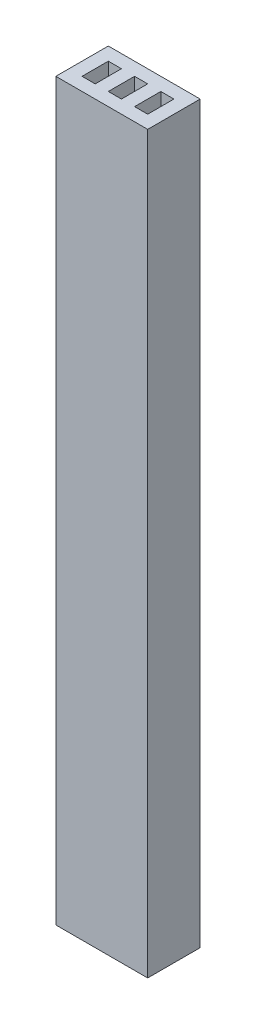
ISO-10303-21;
HEADER;
FILE_DESCRIPTION(('STEP AP214'),'2;1');
FILE_NAME('part.step','',(''),(''),'','','');
FILE_SCHEMA(('AUTOMOTIVE_DESIGN { 1 0 10303 214 1 1 1 1 }'));
ENDSEC;
DATA;
#1=APPLICATION_CONTEXT('core data for automotive mechanical design processes');
#2=APPLICATION_PROTOCOL_DEFINITION('international standard','automotive_design',2000,#1);
#3=PRODUCT_CONTEXT('',#1,'mechanical');
#4=PRODUCT('Part','Part','',(#3));
#5=PRODUCT_RELATED_PRODUCT_CATEGORY('part','',(#4));
#6=PRODUCT_DEFINITION_FORMATION('','',#4);
#7=PRODUCT_DEFINITION_CONTEXT('part definition',#1,'design');
#8=PRODUCT_DEFINITION('design','',#6,#7);
#9=PRODUCT_DEFINITION_SHAPE('','',#8);
#10=(LENGTH_UNIT() NAMED_UNIT(*) SI_UNIT(.MILLI.,.METRE.));
#11=(NAMED_UNIT(*) PLANE_ANGLE_UNIT() SI_UNIT($,.RADIAN.));
#12=(NAMED_UNIT(*) SI_UNIT($,.STERADIAN.) SOLID_ANGLE_UNIT());
#13=UNCERTAINTY_MEASURE_WITH_UNIT(LENGTH_MEASURE(1.E-05),#10,'distance_accuracy_value','');
#14=(GEOMETRIC_REPRESENTATION_CONTEXT(3) GLOBAL_UNCERTAINTY_ASSIGNED_CONTEXT((#13)) GLOBAL_UNIT_ASSIGNED_CONTEXT((#10,
#11,#12)) REPRESENTATION_CONTEXT('',''));
#15=CARTESIAN_POINT('',(0.,0.,0.));
#16=DIRECTION('',(0.,0.,1.));
#17=DIRECTION('',(1.,0.,0.));
#18=AXIS2_PLACEMENT_3D('',#15,#16,#17);
#19=CARTESIAN_POINT('',(0.,56.,0.));
#20=DIRECTION('',(0.,1.,0.));
#21=DIRECTION('',(0.,0.,1.));
#22=AXIS2_PLACEMENT_3D('',#19,#20,#21);
#23=PLANE('',#22);
#24=DIRECTION('',(0.,0.,-1.));
#25=VECTOR('',#24,1.);
#26=CARTESIAN_POINT('',(6.,56.,-3.));
#27=LINE('',#26,#25);
#28=CARTESIAN_POINT('',(6.,56.,1.));
#29=VERTEX_POINT('',#28);
#30=CARTESIAN_POINT('',(6.,56.,-3.));
#31=VERTEX_POINT('',#30);
#32=EDGE_CURVE('E244',#29,#31,#27,.T.);
#33=ORIENTED_EDGE('',*,*,#32,.T.);
#34=DIRECTION('',(-1.,0.,0.));
#35=VECTOR('',#34,1.);
#36=CARTESIAN_POINT('',(-1.,56.,-3.));
#37=LINE('',#36,#35);
#38=CARTESIAN_POINT('',(-1.,56.,-3.));
#39=VERTEX_POINT('',#38);
#40=EDGE_CURVE('E247',#31,#39,#37,.T.);
#41=ORIENTED_EDGE('',*,*,#40,.T.);
#42=DIRECTION('',(0.,0.,1.));
#43=VECTOR('',#42,1.);
#44=CARTESIAN_POINT('',(-1.,56.,-3.));
#45=LINE('',#44,#43);
#46=CARTESIAN_POINT('',(-1.,56.,1.));
#47=VERTEX_POINT('',#46);
#48=EDGE_CURVE('E250',#39,#47,#45,.T.);
#49=ORIENTED_EDGE('',*,*,#48,.T.);
#50=DIRECTION('',(1.,0.,0.));
#51=VECTOR('',#50,1.);
#52=CARTESIAN_POINT('',(-1.,56.,1.));
#53=LINE('',#52,#51);
#54=EDGE_CURVE('E252',#47,#29,#53,.T.);
#55=ORIENTED_EDGE('',*,*,#54,.T.);
#56=EDGE_LOOP('',(#33,#41,#49,#55));
#57=FACE_BOUND('',#56,.T.);
#58=DIRECTION('',(1.,0.,0.));
#59=VECTOR('',#58,1.);
#60=CARTESIAN_POINT('',(0.,56.,0.));
#61=LINE('',#60,#59);
#62=CARTESIAN_POINT('',(0.,56.,0.));
#63=VERTEX_POINT('',#62);
#64=CARTESIAN_POINT('',(1.,56.,0.));
#65=VERTEX_POINT('',#64);
#66=EDGE_CURVE('E215',#63,#65,#61,.T.);
#67=ORIENTED_EDGE('',*,*,#66,.F.);
#68=DIRECTION('',(0.,0.,1.));
#69=VECTOR('',#68,1.);
#70=CARTESIAN_POINT('',(0.,56.,0.));
#71=LINE('',#70,#69);
#72=CARTESIAN_POINT('',(0.,56.,-2.));
#73=VERTEX_POINT('',#72);
#74=EDGE_CURVE('E213',#73,#63,#71,.T.);
#75=ORIENTED_EDGE('',*,*,#74,.F.);
#76=DIRECTION('',(-1.,0.,0.));
#77=VECTOR('',#76,1.);
#78=CARTESIAN_POINT('',(0.,56.,-2.));
#79=LINE('',#78,#77);
#80=CARTESIAN_POINT('',(1.,56.,-2.));
#81=VERTEX_POINT('',#80);
#82=EDGE_CURVE('E221',#81,#73,#79,.T.);
#83=ORIENTED_EDGE('',*,*,#82,.F.);
#84=DIRECTION('',(0.,0.,-1.));
#85=VECTOR('',#84,1.);
#86=CARTESIAN_POINT('',(1.,56.,0.));
#87=LINE('',#86,#85);
#88=EDGE_CURVE('E218',#65,#81,#87,.T.);
#89=ORIENTED_EDGE('',*,*,#88,.F.);
#90=EDGE_LOOP('',(#67,#75,#83,#89));
#91=FACE_BOUND('',#90,.T.);
#92=DIRECTION('',(-1.,0.,0.));
#93=VECTOR('',#92,1.);
#94=CARTESIAN_POINT('',(2.,56.,-2.));
#95=LINE('',#94,#93);
#96=CARTESIAN_POINT('',(3.,56.,-2.));
#97=VERTEX_POINT('',#96);
#98=CARTESIAN_POINT('',(2.,56.,-2.));
#99=VERTEX_POINT('',#98);
#100=EDGE_CURVE('E184',#97,#99,#95,.T.);
#101=ORIENTED_EDGE('',*,*,#100,.F.);
#102=DIRECTION('',(0.,0.,-1.));
#103=VECTOR('',#102,1.);
#104=CARTESIAN_POINT('',(3.,56.,0.));
#105=LINE('',#104,#103);
#106=CARTESIAN_POINT('',(3.,56.,0.));
#107=VERTEX_POINT('',#106);
#108=EDGE_CURVE('E182',#107,#97,#105,.T.);
#109=ORIENTED_EDGE('',*,*,#108,.F.);
#110=DIRECTION('',(1.,0.,0.));
#111=VECTOR('',#110,1.);
#112=CARTESIAN_POINT('',(2.,56.,0.));
#113=LINE('',#112,#111);
#114=CARTESIAN_POINT('',(2.,56.,0.));
#115=VERTEX_POINT('',#114);
#116=EDGE_CURVE('E190',#115,#107,#113,.T.);
#117=ORIENTED_EDGE('',*,*,#116,.F.);
#118=DIRECTION('',(0.,0.,1.));
#119=VECTOR('',#118,1.);
#120=CARTESIAN_POINT('',(2.,56.,0.));
#121=LINE('',#120,#119);
#122=EDGE_CURVE('E187',#99,#115,#121,.T.);
#123=ORIENTED_EDGE('',*,*,#122,.F.);
#124=EDGE_LOOP('',(#101,#109,#117,#123));
#125=FACE_BOUND('',#124,.T.);
#126=DIRECTION('',(-1.,0.,0.));
#127=VECTOR('',#126,1.);
#128=CARTESIAN_POINT('',(4.,56.,-2.));
#129=LINE('',#128,#127);
#130=CARTESIAN_POINT('',(5.,56.,-2.));
#131=VERTEX_POINT('',#130);
#132=CARTESIAN_POINT('',(4.,56.,-2.));
#133=VERTEX_POINT('',#132);
#134=EDGE_CURVE('E154',#131,#133,#129,.T.);
#135=ORIENTED_EDGE('',*,*,#134,.F.);
#136=DIRECTION('',(0.,0.,-1.));
#137=VECTOR('',#136,1.);
#138=CARTESIAN_POINT('',(5.,56.,0.));
#139=LINE('',#138,#137);
#140=CARTESIAN_POINT('',(5.,56.,0.));
#141=VERTEX_POINT('',#140);
#142=EDGE_CURVE('E146',#141,#131,#139,.T.);
#143=ORIENTED_EDGE('',*,*,#142,.F.);
#144=DIRECTION('',(1.,0.,0.));
#145=VECTOR('',#144,1.);
#146=CARTESIAN_POINT('',(4.,56.,0.));
#147=LINE('',#146,#145);
#148=CARTESIAN_POINT('',(4.,56.,0.));
#149=VERTEX_POINT('',#148);
#150=EDGE_CURVE('E168',#149,#141,#147,.T.);
#151=ORIENTED_EDGE('',*,*,#150,.F.);
#152=DIRECTION('',(0.,0.,1.));
#153=VECTOR('',#152,1.);
#154=CARTESIAN_POINT('',(4.,56.,0.));
#155=LINE('',#154,#153);
#156=EDGE_CURVE('E166',#133,#149,#155,.T.);
#157=ORIENTED_EDGE('',*,*,#156,.F.);
#158=EDGE_LOOP('',(#135,#143,#151,#157));
#159=FACE_BOUND('',#158,.T.);
#160=ADVANCED_FACE('F33',(#57,#91,#125,#159),#23,.T.);
#161=CARTESIAN_POINT('',(0.,0.,0.));
#162=DIRECTION('',(0.,1.,0.));
#163=DIRECTION('',(0.,0.,1.));
#164=AXIS2_PLACEMENT_3D('',#161,#162,#163);
#165=PLANE('',#164);
#166=DIRECTION('',(0.,0.,-1.));
#167=VECTOR('',#166,1.);
#168=CARTESIAN_POINT('',(3.,0.,0.));
#169=LINE('',#168,#167);
#170=CARTESIAN_POINT('',(3.,0.,0.));
#171=VERTEX_POINT('',#170);
#172=CARTESIAN_POINT('',(3.,0.,-2.));
#173=VERTEX_POINT('',#172);
#174=EDGE_CURVE('E162',#171,#173,#169,.T.);
#175=ORIENTED_EDGE('',*,*,#174,.T.);
#176=DIRECTION('',(-1.,0.,0.));
#177=VECTOR('',#176,1.);
#178=CARTESIAN_POINT('',(2.,0.,-2.));
#179=LINE('',#178,#177);
#180=CARTESIAN_POINT('',(2.,0.,-2.));
#181=VERTEX_POINT('',#180);
#182=EDGE_CURVE('E195',#173,#181,#179,.T.);
#183=ORIENTED_EDGE('',*,*,#182,.T.);
#184=DIRECTION('',(0.,0.,1.));
#185=VECTOR('',#184,1.);
#186=CARTESIAN_POINT('',(2.,0.,0.));
#187=LINE('',#186,#185);
#188=CARTESIAN_POINT('',(2.,0.,0.));
#189=VERTEX_POINT('',#188);
#190=EDGE_CURVE('E198',#181,#189,#187,.T.);
#191=ORIENTED_EDGE('',*,*,#190,.T.);
#192=DIRECTION('',(1.,0.,0.));
#193=VECTOR('',#192,1.);
#194=CARTESIAN_POINT('',(2.,0.,0.));
#195=LINE('',#194,#193);
#196=EDGE_CURVE('E185',#189,#171,#195,.T.);
#197=ORIENTED_EDGE('',*,*,#196,.T.);
#198=EDGE_LOOP('',(#175,#183,#191,#197));
#199=FACE_BOUND('',#198,.T.);
#200=DIRECTION('',(0.,0.,-1.));
#201=VECTOR('',#200,1.);
#202=CARTESIAN_POINT('',(6.,0.,-3.));
#203=LINE('',#202,#201);
#204=CARTESIAN_POINT('',(6.,0.,1.));
#205=VERTEX_POINT('',#204);
#206=CARTESIAN_POINT('',(6.,0.,-3.));
#207=VERTEX_POINT('',#206);
#208=EDGE_CURVE('E243',#205,#207,#203,.T.);
#209=ORIENTED_EDGE('',*,*,#208,.F.);
#210=DIRECTION('',(1.,0.,0.));
#211=VECTOR('',#210,1.);
#212=CARTESIAN_POINT('',(-1.,0.,1.));
#213=LINE('',#212,#211);
#214=CARTESIAN_POINT('',(-1.,0.,1.));
#215=VERTEX_POINT('',#214);
#216=EDGE_CURVE('E248',#215,#205,#213,.T.);
#217=ORIENTED_EDGE('',*,*,#216,.F.);
#218=DIRECTION('',(0.,0.,1.));
#219=VECTOR('',#218,1.);
#220=CARTESIAN_POINT('',(-1.,0.,-3.));
#221=LINE('',#220,#219);
#222=CARTESIAN_POINT('',(-1.,0.,-3.));
#223=VERTEX_POINT('',#222);
#224=EDGE_CURVE('E259',#223,#215,#221,.T.);
#225=ORIENTED_EDGE('',*,*,#224,.F.);
#226=DIRECTION('',(-1.,0.,0.));
#227=VECTOR('',#226,1.);
#228=CARTESIAN_POINT('',(-1.,0.,-3.));
#229=LINE('',#228,#227);
#230=EDGE_CURVE('E257',#207,#223,#229,.T.);
#231=ORIENTED_EDGE('',*,*,#230,.F.);
#232=EDGE_LOOP('',(#209,#217,#225,#231));
#233=FACE_BOUND('',#232,.T.);
#234=DIRECTION('',(0.,0.,1.));
#235=VECTOR('',#234,1.);
#236=CARTESIAN_POINT('',(0.,0.,0.));
#237=LINE('',#236,#235);
#238=CARTESIAN_POINT('',(0.,0.,-2.));
#239=VERTEX_POINT('',#238);
#240=CARTESIAN_POINT('',(0.,0.,0.));
#241=VERTEX_POINT('',#240);
#242=EDGE_CURVE('E212',#239,#241,#237,.T.);
#243=ORIENTED_EDGE('',*,*,#242,.T.);
#244=DIRECTION('',(1.,0.,0.));
#245=VECTOR('',#244,1.);
#246=CARTESIAN_POINT('',(0.,0.,0.));
#247=LINE('',#246,#245);
#248=CARTESIAN_POINT('',(1.,0.,0.));
#249=VERTEX_POINT('',#248);
#250=EDGE_CURVE('E226',#241,#249,#247,.T.);
#251=ORIENTED_EDGE('',*,*,#250,.T.);
#252=DIRECTION('',(0.,0.,-1.));
#253=VECTOR('',#252,1.);
#254=CARTESIAN_POINT('',(1.,0.,0.));
#255=LINE('',#254,#253);
#256=CARTESIAN_POINT('',(1.,0.,-2.));
#257=VERTEX_POINT('',#256);
#258=EDGE_CURVE('E229',#249,#257,#255,.T.);
#259=ORIENTED_EDGE('',*,*,#258,.T.);
#260=DIRECTION('',(-1.,0.,0.));
#261=VECTOR('',#260,1.);
#262=CARTESIAN_POINT('',(0.,0.,-2.));
#263=LINE('',#262,#261);
#264=EDGE_CURVE('E216',#257,#239,#263,.T.);
#265=ORIENTED_EDGE('',*,*,#264,.T.);
#266=EDGE_LOOP('',(#243,#251,#259,#265));
#267=FACE_BOUND('',#266,.T.);
#268=DIRECTION('',(0.,0.,-1.));
#269=VECTOR('',#268,1.);
#270=CARTESIAN_POINT('',(5.,0.,0.));
#271=LINE('',#270,#269);
#272=CARTESIAN_POINT('',(5.,0.,0.));
#273=VERTEX_POINT('',#272);
#274=CARTESIAN_POINT('',(5.,0.,-2.));
#275=VERTEX_POINT('',#274);
#276=EDGE_CURVE('E56',#273,#275,#271,.T.);
#277=ORIENTED_EDGE('',*,*,#276,.T.);
#278=DIRECTION('',(-1.,0.,0.));
#279=VECTOR('',#278,1.);
#280=CARTESIAN_POINT('',(4.,0.,-2.));
#281=LINE('',#280,#279);
#282=CARTESIAN_POINT('',(4.,0.,-2.));
#283=VERTEX_POINT('',#282);
#284=EDGE_CURVE('E161',#275,#283,#281,.T.);
#285=ORIENTED_EDGE('',*,*,#284,.T.);
#286=DIRECTION('',(0.,0.,1.));
#287=VECTOR('',#286,1.);
#288=CARTESIAN_POINT('',(4.,0.,0.));
#289=LINE('',#288,#287);
#290=CARTESIAN_POINT('',(4.,0.,0.));
#291=VERTEX_POINT('',#290);
#292=EDGE_CURVE('E174',#283,#291,#289,.T.);
#293=ORIENTED_EDGE('',*,*,#292,.T.);
#294=DIRECTION('',(1.,0.,0.));
#295=VECTOR('',#294,1.);
#296=CARTESIAN_POINT('',(4.,0.,0.));
#297=LINE('',#296,#295);
#298=EDGE_CURVE('E155',#291,#273,#297,.T.);
#299=ORIENTED_EDGE('',*,*,#298,.T.);
#300=EDGE_LOOP('',(#277,#285,#293,#299));
#301=FACE_BOUND('',#300,.T.);
#302=ADVANCED_FACE('F277',(#199,#233,#267,#301),#165,.F.);
#303=CARTESIAN_POINT('',(6.,56.,-3.));
#304=DIRECTION('',(-1.,0.,0.));
#305=DIRECTION('',(0.,0.,1.));
#306=AXIS2_PLACEMENT_3D('',#303,#304,#305);
#307=PLANE('',#306);
#308=ORIENTED_EDGE('',*,*,#208,.T.);
#309=DIRECTION('',(0.,-1.,0.));
#310=VECTOR('',#309,1.);
#311=CARTESIAN_POINT('',(6.,56.,-3.));
#312=LINE('',#311,#310);
#313=EDGE_CURVE('E11',#31,#207,#312,.T.);
#314=ORIENTED_EDGE('',*,*,#313,.F.);
#315=ORIENTED_EDGE('',*,*,#32,.F.);
#316=DIRECTION('',(0.,-1.,0.));
#317=VECTOR('',#316,1.);
#318=CARTESIAN_POINT('',(6.,56.,1.));
#319=LINE('',#318,#317);
#320=EDGE_CURVE('E254',#29,#205,#319,.T.);
#321=ORIENTED_EDGE('',*,*,#320,.T.);
#322=EDGE_LOOP('',(#308,#314,#315,#321));
#323=FACE_BOUND('',#322,.T.);
#324=ADVANCED_FACE('F35',(#323),#307,.F.);
#325=CARTESIAN_POINT('',(-1.,56.,-3.));
#326=DIRECTION('',(0.,0.,1.));
#327=DIRECTION('',(1.,0.,0.));
#328=AXIS2_PLACEMENT_3D('',#325,#326,#327);
#329=PLANE('',#328);
#330=ORIENTED_EDGE('',*,*,#230,.T.);
#331=DIRECTION('',(0.,-1.,0.));
#332=VECTOR('',#331,1.);
#333=CARTESIAN_POINT('',(-1.,56.,-3.));
#334=LINE('',#333,#332);
#335=EDGE_CURVE('E41',#39,#223,#334,.T.);
#336=ORIENTED_EDGE('',*,*,#335,.F.);
#337=ORIENTED_EDGE('',*,*,#40,.F.);
#338=ORIENTED_EDGE('',*,*,#313,.T.);
#339=EDGE_LOOP('',(#330,#336,#337,#338));
#340=FACE_BOUND('',#339,.T.);
#341=ADVANCED_FACE('F288',(#340),#329,.F.);
#342=CARTESIAN_POINT('',(-1.,56.,-3.));
#343=DIRECTION('',(1.,0.,0.));
#344=DIRECTION('',(0.,0.,-1.));
#345=AXIS2_PLACEMENT_3D('',#342,#343,#344);
#346=PLANE('',#345);
#347=ORIENTED_EDGE('',*,*,#224,.T.);
#348=DIRECTION('',(0.,-1.,0.));
#349=VECTOR('',#348,1.);
#350=CARTESIAN_POINT('',(-1.,56.,1.));
#351=LINE('',#350,#349);
#352=EDGE_CURVE('E264',#47,#215,#351,.T.);
#353=ORIENTED_EDGE('',*,*,#352,.F.);
#354=ORIENTED_EDGE('',*,*,#48,.F.);
#355=ORIENTED_EDGE('',*,*,#335,.T.);
#356=EDGE_LOOP('',(#347,#353,#354,#355));
#357=FACE_BOUND('',#356,.T.);
#358=ADVANCED_FACE('F271',(#357),#346,.F.);
#359=CARTESIAN_POINT('',(-1.,56.,1.));
#360=DIRECTION('',(0.,0.,-1.));
#361=DIRECTION('',(-1.,0.,0.));
#362=AXIS2_PLACEMENT_3D('',#359,#360,#361);
#363=PLANE('',#362);
#364=ORIENTED_EDGE('',*,*,#216,.T.);
#365=ORIENTED_EDGE('',*,*,#320,.F.);
#366=ORIENTED_EDGE('',*,*,#54,.F.);
#367=ORIENTED_EDGE('',*,*,#352,.T.);
#368=EDGE_LOOP('',(#364,#365,#366,#367));
#369=FACE_BOUND('',#368,.T.);
#370=ADVANCED_FACE('F281',(#369),#363,.F.);
#371=CARTESIAN_POINT('',(0.,56.,0.));
#372=DIRECTION('',(1.,0.,0.));
#373=DIRECTION('',(0.,0.,-1.));
#374=AXIS2_PLACEMENT_3D('',#371,#372,#373);
#375=PLANE('',#374);
#376=ORIENTED_EDGE('',*,*,#242,.F.);
#377=DIRECTION('',(0.,-1.,0.));
#378=VECTOR('',#377,1.);
#379=CARTESIAN_POINT('',(0.,56.,-2.));
#380=LINE('',#379,#378);
#381=EDGE_CURVE('E223',#73,#239,#380,.T.);
#382=ORIENTED_EDGE('',*,*,#381,.F.);
#383=ORIENTED_EDGE('',*,*,#74,.T.);
#384=DIRECTION('',(0.,-1.,0.));
#385=VECTOR('',#384,1.);
#386=CARTESIAN_POINT('',(0.,56.,0.));
#387=LINE('',#386,#385);
#388=EDGE_CURVE('E240',#63,#241,#387,.T.);
#389=ORIENTED_EDGE('',*,*,#388,.T.);
#390=EDGE_LOOP('',(#376,#382,#383,#389));
#391=FACE_BOUND('',#390,.T.);
#392=ADVANCED_FACE('F303',(#391),#375,.T.);
#393=CARTESIAN_POINT('',(0.,56.,0.));
#394=DIRECTION('',(0.,0.,-1.));
#395=DIRECTION('',(-1.,0.,0.));
#396=AXIS2_PLACEMENT_3D('',#393,#394,#395);
#397=PLANE('',#396);
#398=ORIENTED_EDGE('',*,*,#250,.F.);
#399=ORIENTED_EDGE('',*,*,#388,.F.);
#400=ORIENTED_EDGE('',*,*,#66,.T.);
#401=DIRECTION('',(0.,-1.,0.));
#402=VECTOR('',#401,1.);
#403=CARTESIAN_POINT('',(1.,56.,0.));
#404=LINE('',#403,#402);
#405=EDGE_CURVE('E238',#65,#249,#404,.T.);
#406=ORIENTED_EDGE('',*,*,#405,.T.);
#407=EDGE_LOOP('',(#398,#399,#400,#406));
#408=FACE_BOUND('',#407,.T.);
#409=ADVANCED_FACE('F310',(#408),#397,.T.);
#410=CARTESIAN_POINT('',(1.,56.,0.));
#411=DIRECTION('',(-1.,0.,0.));
#412=DIRECTION('',(0.,0.,1.));
#413=AXIS2_PLACEMENT_3D('',#410,#411,#412);
#414=PLANE('',#413);
#415=ORIENTED_EDGE('',*,*,#258,.F.);
#416=ORIENTED_EDGE('',*,*,#405,.F.);
#417=ORIENTED_EDGE('',*,*,#88,.T.);
#418=DIRECTION('',(0.,-1.,0.));
#419=VECTOR('',#418,1.);
#420=CARTESIAN_POINT('',(1.,56.,-2.));
#421=LINE('',#420,#419);
#422=EDGE_CURVE('E236',#81,#257,#421,.T.);
#423=ORIENTED_EDGE('',*,*,#422,.T.);
#424=EDGE_LOOP('',(#415,#416,#417,#423));
#425=FACE_BOUND('',#424,.T.);
#426=ADVANCED_FACE('F315',(#425),#414,.T.);
#427=CARTESIAN_POINT('',(0.,56.,-2.));
#428=DIRECTION('',(0.,0.,1.));
#429=DIRECTION('',(1.,0.,0.));
#430=AXIS2_PLACEMENT_3D('',#427,#428,#429);
#431=PLANE('',#430);
#432=ORIENTED_EDGE('',*,*,#264,.F.);
#433=ORIENTED_EDGE('',*,*,#422,.F.);
#434=ORIENTED_EDGE('',*,*,#82,.T.);
#435=ORIENTED_EDGE('',*,*,#381,.T.);
#436=EDGE_LOOP('',(#432,#433,#434,#435));
#437=FACE_BOUND('',#436,.T.);
#438=ADVANCED_FACE('F322',(#437),#431,.T.);
#439=CARTESIAN_POINT('',(3.,56.,0.));
#440=DIRECTION('',(-1.,0.,0.));
#441=DIRECTION('',(0.,0.,1.));
#442=AXIS2_PLACEMENT_3D('',#439,#440,#441);
#443=PLANE('',#442);
#444=ORIENTED_EDGE('',*,*,#174,.F.);
#445=DIRECTION('',(0.,-1.,0.));
#446=VECTOR('',#445,1.);
#447=CARTESIAN_POINT('',(3.,56.,0.));
#448=LINE('',#447,#446);
#449=EDGE_CURVE('E192',#107,#171,#448,.T.);
#450=ORIENTED_EDGE('',*,*,#449,.F.);
#451=ORIENTED_EDGE('',*,*,#108,.T.);
#452=DIRECTION('',(0.,-1.,0.));
#453=VECTOR('',#452,1.);
#454=CARTESIAN_POINT('',(3.,56.,-2.));
#455=LINE('',#454,#453);
#456=EDGE_CURVE('E209',#97,#173,#455,.T.);
#457=ORIENTED_EDGE('',*,*,#456,.T.);
#458=EDGE_LOOP('',(#444,#450,#451,#457));
#459=FACE_BOUND('',#458,.T.);
#460=ADVANCED_FACE('F344',(#459),#443,.T.);
#461=CARTESIAN_POINT('',(2.,56.,-2.));
#462=DIRECTION('',(0.,0.,1.));
#463=DIRECTION('',(1.,0.,0.));
#464=AXIS2_PLACEMENT_3D('',#461,#462,#463);
#465=PLANE('',#464);
#466=ORIENTED_EDGE('',*,*,#182,.F.);
#467=ORIENTED_EDGE('',*,*,#456,.F.);
#468=ORIENTED_EDGE('',*,*,#100,.T.);
#469=DIRECTION('',(0.,-1.,0.));
#470=VECTOR('',#469,1.);
#471=CARTESIAN_POINT('',(2.,56.,-2.));
#472=LINE('',#471,#470);
#473=EDGE_CURVE('E207',#99,#181,#472,.T.);
#474=ORIENTED_EDGE('',*,*,#473,.T.);
#475=EDGE_LOOP('',(#466,#467,#468,#474));
#476=FACE_BOUND('',#475,.T.);
#477=ADVANCED_FACE('F338',(#476),#465,.T.);
#478=CARTESIAN_POINT('',(2.,56.,0.));
#479=DIRECTION('',(1.,0.,0.));
#480=DIRECTION('',(0.,0.,-1.));
#481=AXIS2_PLACEMENT_3D('',#478,#479,#480);
#482=PLANE('',#481);
#483=ORIENTED_EDGE('',*,*,#190,.F.);
#484=ORIENTED_EDGE('',*,*,#473,.F.);
#485=ORIENTED_EDGE('',*,*,#122,.T.);
#486=DIRECTION('',(0.,-1.,0.));
#487=VECTOR('',#486,1.);
#488=CARTESIAN_POINT('',(2.,56.,0.));
#489=LINE('',#488,#487);
#490=EDGE_CURVE('E205',#115,#189,#489,.T.);
#491=ORIENTED_EDGE('',*,*,#490,.T.);
#492=EDGE_LOOP('',(#483,#484,#485,#491));
#493=FACE_BOUND('',#492,.T.);
#494=ADVANCED_FACE('F341',(#493),#482,.T.);
#495=CARTESIAN_POINT('',(2.,56.,0.));
#496=DIRECTION('',(0.,0.,-1.));
#497=DIRECTION('',(-1.,0.,0.));
#498=AXIS2_PLACEMENT_3D('',#495,#496,#497);
#499=PLANE('',#498);
#500=ORIENTED_EDGE('',*,*,#196,.F.);
#501=ORIENTED_EDGE('',*,*,#490,.F.);
#502=ORIENTED_EDGE('',*,*,#116,.T.);
#503=ORIENTED_EDGE('',*,*,#449,.T.);
#504=EDGE_LOOP('',(#500,#501,#502,#503));
#505=FACE_BOUND('',#504,.T.);
#506=ADVANCED_FACE('F347',(#505),#499,.T.);
#507=CARTESIAN_POINT('',(5.,56.,0.));
#508=DIRECTION('',(-1.,0.,0.));
#509=DIRECTION('',(0.,0.,1.));
#510=AXIS2_PLACEMENT_3D('',#507,#508,#509);
#511=PLANE('',#510);
#512=ORIENTED_EDGE('',*,*,#276,.F.);
#513=DIRECTION('',(0.,-1.,0.));
#514=VECTOR('',#513,1.);
#515=CARTESIAN_POINT('',(5.,56.,0.));
#516=LINE('',#515,#514);
#517=EDGE_CURVE('E150',#141,#273,#516,.T.);
#518=ORIENTED_EDGE('',*,*,#517,.F.);
#519=ORIENTED_EDGE('',*,*,#142,.T.);
#520=DIRECTION('',(0.,-1.,0.));
#521=VECTOR('',#520,1.);
#522=CARTESIAN_POINT('',(5.,56.,-2.));
#523=LINE('',#522,#521);
#524=EDGE_CURVE('E149',#131,#275,#523,.T.);
#525=ORIENTED_EDGE('',*,*,#524,.T.);
#526=EDGE_LOOP('',(#512,#518,#519,#525));
#527=FACE_BOUND('',#526,.T.);
#528=ADVANCED_FACE('F148',(#527),#511,.T.);
#529=CARTESIAN_POINT('',(4.,56.,-2.));
#530=DIRECTION('',(0.,0.,1.));
#531=DIRECTION('',(1.,0.,0.));
#532=AXIS2_PLACEMENT_3D('',#529,#530,#531);
#533=PLANE('',#532);
#534=ORIENTED_EDGE('',*,*,#284,.F.);
#535=ORIENTED_EDGE('',*,*,#524,.F.);
#536=ORIENTED_EDGE('',*,*,#134,.T.);
#537=DIRECTION('',(0.,-1.,0.));
#538=VECTOR('',#537,1.);
#539=CARTESIAN_POINT('',(4.,56.,-2.));
#540=LINE('',#539,#538);
#541=EDGE_CURVE('E163',#133,#283,#540,.T.);
#542=ORIENTED_EDGE('',*,*,#541,.T.);
#543=EDGE_LOOP('',(#534,#535,#536,#542));
#544=FACE_BOUND('',#543,.T.);
#545=ADVANCED_FACE('F158',(#544),#533,.T.);
#546=CARTESIAN_POINT('',(4.,56.,0.));
#547=DIRECTION('',(1.,0.,0.));
#548=DIRECTION('',(0.,0.,-1.));
#549=AXIS2_PLACEMENT_3D('',#546,#547,#548);
#550=PLANE('',#549);
#551=ORIENTED_EDGE('',*,*,#292,.F.);
#552=ORIENTED_EDGE('',*,*,#541,.F.);
#553=ORIENTED_EDGE('',*,*,#156,.T.);
#554=DIRECTION('',(0.,-1.,0.));
#555=VECTOR('',#554,1.);
#556=CARTESIAN_POINT('',(4.,56.,0.));
#557=LINE('',#556,#555);
#558=EDGE_CURVE('E48',#149,#291,#557,.T.);
#559=ORIENTED_EDGE('',*,*,#558,.T.);
#560=EDGE_LOOP('',(#551,#552,#553,#559));
#561=FACE_BOUND('',#560,.T.);
#562=ADVANCED_FACE('F404',(#561),#550,.T.);
#563=CARTESIAN_POINT('',(4.,56.,0.));
#564=DIRECTION('',(0.,0.,-1.));
#565=DIRECTION('',(-1.,0.,0.));
#566=AXIS2_PLACEMENT_3D('',#563,#564,#565);
#567=PLANE('',#566);
#568=ORIENTED_EDGE('',*,*,#298,.F.);
#569=ORIENTED_EDGE('',*,*,#558,.F.);
#570=ORIENTED_EDGE('',*,*,#150,.T.);
#571=ORIENTED_EDGE('',*,*,#517,.T.);
#572=EDGE_LOOP('',(#568,#569,#570,#571));
#573=FACE_BOUND('',#572,.T.);
#574=ADVANCED_FACE('F412',(#573),#567,.T.);
#575=CLOSED_SHELL('',(#160,#302,#324,#341,#358,#370,#392,#409,#426,#438,#460,#477,#494,#506,
#528,#545,#562,#574));
#576=MANIFOLD_SOLID_BREP('B2',#575);
#577=ADVANCED_BREP_SHAPE_REPRESENTATION('',(#18,#576),#14);
#578=SHAPE_DEFINITION_REPRESENTATION(#9,#577);
ENDSEC;
END-ISO-10303-21;
